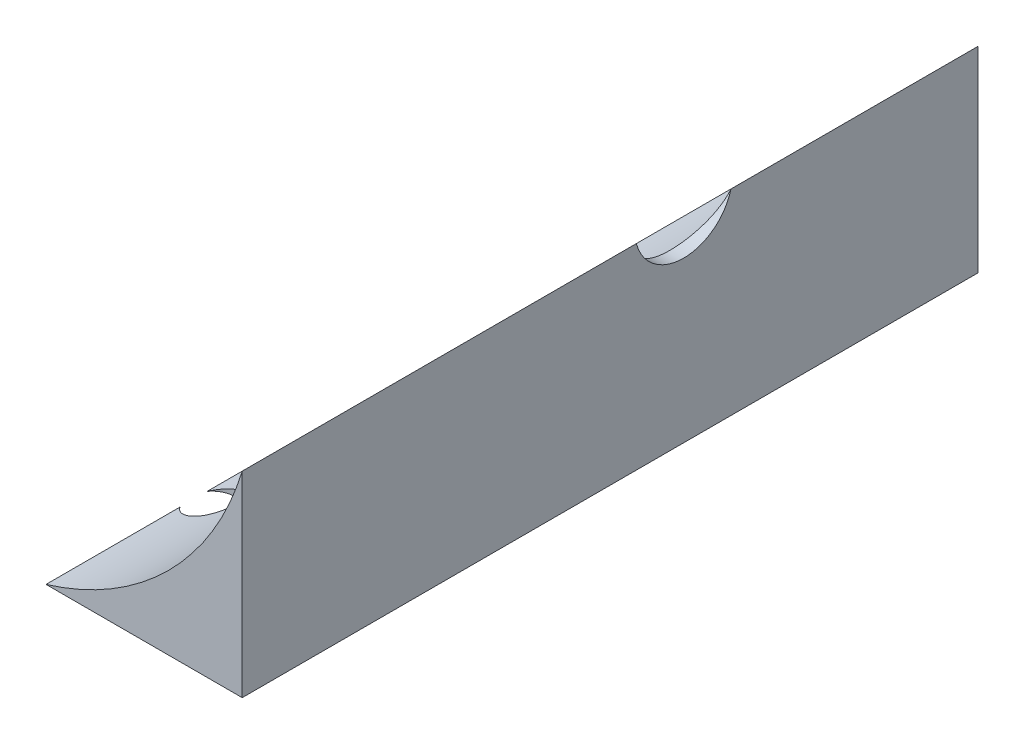
ISO-10303-21;
HEADER;
FILE_DESCRIPTION(('STEP AP214'),'2;1');
FILE_NAME('part.step','',(''),(''),'','','');
FILE_SCHEMA(('AUTOMOTIVE_DESIGN { 1 0 10303 214 1 1 1 1 }'));
ENDSEC;
DATA;
#1=APPLICATION_CONTEXT('core data for automotive mechanical design processes');
#2=APPLICATION_PROTOCOL_DEFINITION('international standard','automotive_design',2000,#1);
#3=PRODUCT_CONTEXT('',#1,'mechanical');
#4=PRODUCT('Part','Part','',(#3));
#5=PRODUCT_RELATED_PRODUCT_CATEGORY('part','',(#4));
#6=PRODUCT_DEFINITION_FORMATION('','',#4);
#7=PRODUCT_DEFINITION_CONTEXT('part definition',#1,'design');
#8=PRODUCT_DEFINITION('design','',#6,#7);
#9=PRODUCT_DEFINITION_SHAPE('','',#8);
#10=(LENGTH_UNIT() NAMED_UNIT(*) SI_UNIT(.MILLI.,.METRE.));
#11=(NAMED_UNIT(*) PLANE_ANGLE_UNIT() SI_UNIT($,.RADIAN.));
#12=(NAMED_UNIT(*) SI_UNIT($,.STERADIAN.) SOLID_ANGLE_UNIT());
#13=UNCERTAINTY_MEASURE_WITH_UNIT(LENGTH_MEASURE(1.E-05),#10,'distance_accuracy_value','');
#14=(GEOMETRIC_REPRESENTATION_CONTEXT(3) GLOBAL_UNCERTAINTY_ASSIGNED_CONTEXT((#13)) GLOBAL_UNIT_ASSIGNED_CONTEXT((#10,
#11,#12)) REPRESENTATION_CONTEXT('',''));
#15=CARTESIAN_POINT('',(0.,0.,0.));
#16=DIRECTION('',(0.,0.,1.));
#17=DIRECTION('',(1.,0.,0.));
#18=AXIS2_PLACEMENT_3D('',#15,#16,#17);
#19=CARTESIAN_POINT('',(0.,0.,75.));
#20=DIRECTION('',(0.,1.,0.));
#21=DIRECTION('',(-1.,0.,0.));
#22=AXIS2_PLACEMENT_3D('',#19,#20,#21);
#23=PLANE('',#22);
#24=DIRECTION('',(0.,0.,-1.));
#25=VECTOR('',#24,1.);
#26=CARTESIAN_POINT('',(-20.,0.,75.));
#27=LINE('',#26,#25);
#28=CARTESIAN_POINT('',(-20.,0.,75.));
#29=VERTEX_POINT('',#28);
#30=CARTESIAN_POINT('',(-20.,0.,61.3504253735184));
#31=VERTEX_POINT('',#30);
#32=EDGE_CURVE('E91',#29,#31,#27,.T.);
#33=ORIENTED_EDGE('',*,*,#32,.T.);
#34=CARTESIAN_POINT('',(-18.1137057403655,0.,59.963970786125));
#35=DIRECTION('',(0.,-1.,0.));
#36=DIRECTION('',(1.,0.,0.));
#37=AXIS2_PLACEMENT_3D('',#34,#35,#36);
#38=CIRCLE('',#37,2.34101737644858);
#39=CARTESIAN_POINT('',(-20.,0.,58.5775161987316));
#40=VERTEX_POINT('',#39);
#41=EDGE_CURVE('E52',#40,#31,#38,.T.);
#42=ORIENTED_EDGE('',*,*,#41,.F.);
#43=CARTESIAN_POINT('',(-20.,0.,0.));
#44=VERTEX_POINT('',#43);
#45=EDGE_CURVE('E88',#40,#44,#27,.T.);
#46=ORIENTED_EDGE('',*,*,#45,.T.);
#47=DIRECTION('',(1.,0.,0.));
#48=VECTOR('',#47,1.);
#49=CARTESIAN_POINT('',(0.,0.,0.));
#50=LINE('',#49,#48);
#51=CARTESIAN_POINT('',(0.,0.,0.));
#52=VERTEX_POINT('',#51);
#53=EDGE_CURVE('E148',#44,#52,#50,.T.);
#54=ORIENTED_EDGE('',*,*,#53,.T.);
#55=DIRECTION('',(0.,0.,-1.));
#56=VECTOR('',#55,1.);
#57=CARTESIAN_POINT('',(0.,0.,75.));
#58=LINE('',#57,#56);
#59=CARTESIAN_POINT('',(0.,0.,75.));
#60=VERTEX_POINT('',#59);
#61=EDGE_CURVE('E108',#60,#52,#58,.T.);
#62=ORIENTED_EDGE('',*,*,#61,.F.);
#63=DIRECTION('',(1.,0.,0.));
#64=VECTOR('',#63,1.);
#65=CARTESIAN_POINT('',(0.,0.,75.));
#66=LINE('',#65,#64);
#67=EDGE_CURVE('E145',#29,#60,#66,.T.);
#68=ORIENTED_EDGE('',*,*,#67,.F.);
#69=EDGE_LOOP('',(#33,#42,#46,#54,#62,#68));
#70=FACE_BOUND('',#69,.T.);
#71=ADVANCED_FACE('F34',(#70),#23,.F.);
#72=CARTESIAN_POINT('',(0.,0.,75.));
#73=DIRECTION('',(-1.,0.,0.));
#74=DIRECTION('',(0.,0.,1.));
#75=AXIS2_PLACEMENT_3D('',#72,#73,#74);
#76=PLANE('',#75);
#77=DIRECTION('',(0.,0.,-1.));
#78=VECTOR('',#77,1.);
#79=CARTESIAN_POINT('',(0.,20.,75.));
#80=LINE('',#79,#78);
#81=CARTESIAN_POINT('',(0.,20.,25.1719569181705));
#82=VERTEX_POINT('',#81);
#83=CARTESIAN_POINT('',(0.,20.,0.));
#84=VERTEX_POINT('',#83);
#85=EDGE_CURVE('E99',#82,#84,#80,.T.);
#86=ORIENTED_EDGE('',*,*,#85,.F.);
#87=CARTESIAN_POINT('',(0.,21.3,29.9999999999998));
#88=DIRECTION('',(1.,0.,0.));
#89=DIRECTION('',(0.,0.,-1.));
#90=AXIS2_PLACEMENT_3D('',#87,#88,#89);
#91=CIRCLE('',#90,5.);
#92=CARTESIAN_POINT('',(0.,20.,34.8280430818291));
#93=VERTEX_POINT('',#92);
#94=EDGE_CURVE('E58',#93,#82,#91,.T.);
#95=ORIENTED_EDGE('',*,*,#94,.F.);
#96=CARTESIAN_POINT('',(0.,20.,75.));
#97=VERTEX_POINT('',#96);
#98=EDGE_CURVE('E105',#97,#93,#80,.T.);
#99=ORIENTED_EDGE('',*,*,#98,.F.);
#100=DIRECTION('',(0.,1.,0.));
#101=VECTOR('',#100,1.);
#102=CARTESIAN_POINT('',(0.,0.,75.));
#103=LINE('',#102,#101);
#104=EDGE_CURVE('E100',#60,#97,#103,.T.);
#105=ORIENTED_EDGE('',*,*,#104,.F.);
#106=ORIENTED_EDGE('',*,*,#61,.T.);
#107=DIRECTION('',(0.,1.,0.));
#108=VECTOR('',#107,1.);
#109=CARTESIAN_POINT('',(0.,0.,0.));
#110=LINE('',#109,#108);
#111=EDGE_CURVE('E141',#52,#84,#110,.T.);
#112=ORIENTED_EDGE('',*,*,#111,.T.);
#113=EDGE_LOOP('',(#86,#95,#99,#105,#106,#112));
#114=FACE_BOUND('',#113,.T.);
#115=ADVANCED_FACE('F130',(#114),#76,.F.);
#116=CARTESIAN_POINT('',(-28.7082869338697,28.7082869338697,75.));
#117=DIRECTION('',(0.,0.,-1.));
#118=DIRECTION('',(-1.,0.,0.));
#119=AXIS2_PLACEMENT_3D('',#116,#117,#118);
#120=CYLINDRICAL_SURFACE('',#119,30.);
#121=ORIENTED_EDGE('',*,*,#45,.F.);
#122=CARTESIAN_POINT('',(-20.,0.,58.5775161987316));
#123=CARTESIAN_POINT('',(-19.9603852167004,0.0120163993603555,58.5236065563983));
#124=CARTESIAN_POINT('',(-19.9185346524436,0.0248009634564151,58.4715229348385));
#125=CARTESIAN_POINT('',(-19.8307699291893,0.0518426986991115,58.3713386677608));
#126=CARTESIAN_POINT('',(-19.7848569685702,0.066099435771002,58.3232368556878));
#127=CARTESIAN_POINT('',(-19.6894806363469,0.0959885123284485,58.2314392068463));
#128=CARTESIAN_POINT('',(-19.6400271890594,0.111617032416786,58.1877318207844));
#129=CARTESIAN_POINT('',(-19.5378958903817,0.144204413541176,58.104837592553));
#130=CARTESIAN_POINT('',(-19.4852178791001,0.161163340557791,58.0656509748262));
#131=CARTESIAN_POINT('',(-19.3230566683905,0.213896237302644,57.9552687608129));
#132=CARTESIAN_POINT('',(-19.2092917601135,0.251574387481096,57.8911031179173));
#133=CARTESIAN_POINT('',(-18.9740019781249,0.331198485191561,57.7829021524693));
#134=CARTESIAN_POINT('',(-18.8524734617509,0.373146441663057,57.738876359717));
#135=CARTESIAN_POINT('',(-18.6001609578884,0.462148316259254,57.6701823675214));
#136=CARTESIAN_POINT('',(-18.469200840092,0.509337464192126,57.6463348382152));
#137=CARTESIAN_POINT('',(-18.2060727754634,0.606273144824774,57.6210414309416));
#138=CARTESIAN_POINT('',(-18.0739045036713,0.656020383279902,57.6196017687446));
#139=CARTESIAN_POINT('',(-17.805069785958,0.759376239201831,57.6392837591402));
#140=CARTESIAN_POINT('',(-17.6685122778561,0.813053115037786,57.6615459459823));
#141=CARTESIAN_POINT('',(-17.4013495651599,0.920269575229427,57.7297086999404));
#142=CARTESIAN_POINT('',(-17.2707456176706,0.973809128357518,57.7756142344558));
#143=CARTESIAN_POINT('',(-17.0161137503511,1.08017523292484,57.8913747755031));
#144=CARTESIAN_POINT('',(-16.8923040275771,1.13295760265286,57.9617526123569));
#145=CARTESIAN_POINT('',(-16.6583444679612,1.23438733199774,58.1247843536203));
#146=CARTESIAN_POINT('',(-16.548194259832,1.28303480399639,58.2174376523462));
#147=CARTESIAN_POINT('',(-16.3487860228036,1.37233434831674,58.4196529821586));
#148=CARTESIAN_POINT('',(-16.2589616088891,1.41319620120892,58.5285613563386));
#149=CARTESIAN_POINT('',(-16.099408738527,1.48653223029614,58.7627213105352));
#150=CARTESIAN_POINT('',(-16.0296667988399,1.51901203261649,58.8879618427881));
#151=CARTESIAN_POINT('',(-15.9186856901359,1.57105149133239,59.1396492681334));
#152=CARTESIAN_POINT('',(-15.8755057492662,1.59148443410326,59.2650587463085));
#153=CARTESIAN_POINT('',(-15.8108651957181,1.62216831594949,59.5225318613281));
#154=CARTESIAN_POINT('',(-15.7893901072295,1.63242604118832,59.6545910014642));
#155=CARTESIAN_POINT('',(-15.770142147622,1.64161923428046,59.909371634492));
#156=CARTESIAN_POINT('',(-15.7704951178566,1.64144996949367,60.0319230566387));
#157=CARTESIAN_POINT('',(-15.7902536286833,1.63201438843243,60.2751073642671));
#158=CARTESIAN_POINT('',(-15.8096561023882,1.62274953650789,60.3957405553989));
#159=CARTESIAN_POINT('',(-15.8659693220632,1.59600542082622,60.6288780180972));
#160=CARTESIAN_POINT('',(-15.9024665612805,1.57872024912813,60.7415055172166));
#161=CARTESIAN_POINT('',(-15.9913555799345,1.53694069515482,60.9588504722534));
#162=CARTESIAN_POINT('',(-16.0437500407649,1.51244509671354,61.0635665900291));
#163=CARTESIAN_POINT('',(-16.165621627243,1.4560161647296,61.267880627343));
#164=CARTESIAN_POINT('',(-16.2358232378518,1.4237716199685,61.3669590833492));
#165=CARTESIAN_POINT('',(-16.3895292264913,1.35403083655854,61.5520726379876));
#166=CARTESIAN_POINT('',(-16.4730384099468,1.31653270140761,61.638103002908));
#167=CARTESIAN_POINT('',(-16.658965341979,1.23420731930407,61.8026734876179));
#168=CARTESIAN_POINT('',(-16.7624006007913,1.18902545256688,61.8798868924439));
#169=CARTESIAN_POINT('',(-16.9795530445125,1.0957757488691,62.015919191892));
#170=CARTESIAN_POINT('',(-17.0932740400071,1.04770684457365,62.0747312330299));
#171=CARTESIAN_POINT('',(-17.3373772098319,0.946421628248159,62.1767734542265));
#172=CARTESIAN_POINT('',(-17.4683676550296,0.893094946906978,62.2184445080831));
#173=CARTESIAN_POINT('',(-17.7356777929453,0.786564930145201,62.2783231053039));
#174=CARTESIAN_POINT('',(-17.8719988012845,0.733361628651809,62.296524818124));
#175=CARTESIAN_POINT('',(-18.1504140095533,0.627080638668843,62.3089631973864));
#176=CARTESIAN_POINT('',(-18.2925603279635,0.57405231364882,62.3024819963338));
#177=CARTESIAN_POINT('',(-18.5745111188379,0.471270456993035,62.2635933122109));
#178=CARTESIAN_POINT('',(-18.7143156227032,0.421516881420414,62.231186177062));
#179=CARTESIAN_POINT('',(-18.9837931840418,0.327763541425243,62.1418099826327));
#180=CARTESIAN_POINT('',(-19.1136283702825,0.283654832260102,62.0854452927666));
#181=CARTESIAN_POINT('',(-19.3622420379419,0.2009442529262,61.9493054999235));
#182=CARTESIAN_POINT('',(-19.4810327181965,0.162336281382611,61.8695566396365));
#183=CARTESIAN_POINT('',(-19.6682124097427,0.102632170047962,61.7171203832869));
#184=CARTESIAN_POINT('',(-19.7407172230383,0.079843360189809,61.6500751138656));
#185=CARTESIAN_POINT('',(-19.8771255165398,0.0374707372427867,61.5068640275036));
#186=CARTESIAN_POINT('',(-19.9410297688374,0.0178866364258815,61.430699030423));
#187=CARTESIAN_POINT('',(-20.,0.,61.3504253735185));
#188=B_SPLINE_CURVE_WITH_KNOTS('',3,(#122,#123,#124,#125,#126,#127,#128,#129,#130,#131,#132,
#133,#134,#135,#136,#137,#138,#139,#140,#141,#142,#143,#144,#145,#146,#147,#148,#149,#150,#151,
#152,#153,#154,#155,#156,#157,#158,#159,#160,#161,#162,#163,#164,#165,#166,#167,#168,#169,#170,
#171,#172,#173,#174,#175,#176,#177,#178,#179,#180,#181,#182,#183,#184,#185,#186,#187),
.UNSPECIFIED.,.F.,.F.,(4,2,2,2,2,2,2,2,2,2,2,2,2,2,2,2,2,2,2,2,2,2,2,2,2,2,2,2,2,2,2,2,4),(0.,
0.203831624930499,0.407603320164647,0.610824643973673,0.814056052775617,1.21986975760009,
1.62587528775139,2.04769295579348,2.46962763073394,2.9128238555078,3.35611323254066,
3.80952270825268,4.26291985687267,4.70145799956251,5.13970102048073,5.54011304535372,
5.94025784330446,6.3060981963826,6.67187966041526,7.02923716657789,7.38665498197951,
7.76198408414485,8.13744902775976,8.54597734865684,8.95465764300319,9.39498239516984,
9.83541651719867,10.2887565140752,10.7420904273113,11.1846100066247,11.6266348603919,
11.9298997969065,12.233137490462),.UNSPECIFIED.);
#189=EDGE_CURVE('E11',#40,#31,#188,.T.);
#190=ORIENTED_EDGE('',*,*,#189,.T.);
#191=ORIENTED_EDGE('',*,*,#32,.F.);
#192=CARTESIAN_POINT('',(-28.7082869338697,28.7082869338697,75.));
#193=DIRECTION('',(0.,0.,-1.));
#194=DIRECTION('',(-1.,0.,0.));
#195=AXIS2_PLACEMENT_3D('',#192,#193,#194);
#196=CIRCLE('',#195,30.);
#197=EDGE_CURVE('E97',#97,#29,#196,.T.);
#198=ORIENTED_EDGE('',*,*,#197,.F.);
#199=ORIENTED_EDGE('',*,*,#98,.T.);
#200=CARTESIAN_POINT('',(0.,20.,34.8280430818291));
#201=CARTESIAN_POINT('',(-0.042887026278017,19.8585842091166,34.7899741655263));
#202=CARTESIAN_POINT('',(-0.0863715901544593,19.7190227228772,34.7457241464061));
#203=CARTESIAN_POINT('',(-0.174044149430088,19.4445078905262,34.6452650537872));
#204=CARTESIAN_POINT('',(-0.218232110324775,19.3095543193926,34.5890565652381));
#205=CARTESIAN_POINT('',(-0.306867358888854,19.0450117615809,34.4650193607295));
#206=CARTESIAN_POINT('',(-0.351314857629725,18.9154281412724,34.3971793529178));
#207=CARTESIAN_POINT('',(-0.439887537125641,18.6626148951078,34.2503606588804));
#208=CARTESIAN_POINT('',(-0.484012716864898,18.5393852892689,34.171381937567));
#209=CARTESIAN_POINT('',(-0.571384595045427,18.3000707713527,34.0027316856505));
#210=CARTESIAN_POINT('',(-0.614630987590236,18.1839883195194,33.9130565038928));
#211=CARTESIAN_POINT('',(-0.699639914871906,17.959795369318,33.7235180518632));
#212=CARTESIAN_POINT('',(-0.74140192756869,17.8516876614831,33.6236512441858));
#213=CARTESIAN_POINT('',(-0.822770908320459,17.6443638810265,33.4143823116233));
#214=CARTESIAN_POINT('',(-0.862379023308245,17.5451430576324,33.3049853438466));
#215=CARTESIAN_POINT('',(-0.938808001284255,17.3563526114925,33.0772580758209));
#216=CARTESIAN_POINT('',(-0.97562907185665,17.2667822697504,32.9589284422069));
#217=CARTESIAN_POINT('',(-1.04503556523586,17.0999923683878,32.7168103864804));
#218=CARTESIAN_POINT('',(-1.07769740126124,17.0225410616619,32.5932036561227));
#219=CARTESIAN_POINT('',(-1.13909704816072,16.8784134825281,32.3389974918441));
#220=CARTESIAN_POINT('',(-1.16783657003949,16.8117325095057,32.2084011417931));
#221=CARTESIAN_POINT('',(-1.22081481232475,16.6898304457914,31.9411100757477));
#222=CARTESIAN_POINT('',(-1.24505433019101,16.6346073244134,31.8044164456067));
#223=CARTESIAN_POINT('',(-1.28850073332385,16.5362608011341,31.5259697324746));
#224=CARTESIAN_POINT('',(-1.30770806075715,16.4931363361288,31.384217095251));
#225=CARTESIAN_POINT('',(-1.33933406030908,16.4224497422271,31.1082243246949));
#226=CARTESIAN_POINT('',(-1.35216972045267,16.3939260299754,30.9742775958439));
#227=CARTESIAN_POINT('',(-1.37292025518578,16.3479322428485,30.7041269106709));
#228=CARTESIAN_POINT('',(-1.38083550158806,16.3304613327625,30.5679231257028));
#229=CARTESIAN_POINT('',(-1.39157077630319,16.306787515676,30.2943932282242));
#230=CARTESIAN_POINT('',(-1.39439278066974,16.3005802386554,30.157067571754));
#231=CARTESIAN_POINT('',(-1.39488461280556,16.2994975042032,29.8823640306354));
#232=CARTESIAN_POINT('',(-1.392554613579,16.304621666262,29.7449861478957));
#233=CARTESIAN_POINT('',(-1.38309924118561,16.325466745392,29.4798137277718));
#234=CARTESIAN_POINT('',(-1.37628087940518,16.3405093278537,29.3519541934166));
#235=CARTESIAN_POINT('',(-1.35828874684916,16.3803480664252,29.0980324591644));
#236=CARTESIAN_POINT('',(-1.34711356610042,16.4051473800756,28.9719708548257));
#237=CARTESIAN_POINT('',(-1.32062114039416,16.4642349840787,28.7225833255722));
#238=CARTESIAN_POINT('',(-1.30530523400811,16.4985202080068,28.5992565304928));
#239=CARTESIAN_POINT('',(-1.27079846465826,16.5762617857426,28.3560395531981));
#240=CARTESIAN_POINT('',(-1.25160612797161,16.6197216277978,28.2361506978578));
#241=CARTESIAN_POINT('',(-1.20935549371086,16.7161403901432,27.9987794494362));
#242=CARTESIAN_POINT('',(-1.1862430022915,16.7692333202247,27.8813610859061));
#243=CARTESIAN_POINT('',(-1.13674125979757,16.8839993605764,27.651497260674));
#244=CARTESIAN_POINT('',(-1.11035083107222,16.9456755554839,27.539053606005));
#245=CARTESIAN_POINT('',(-1.02686876945311,17.142845106302,27.2101424524249));
#246=CARTESIAN_POINT('',(-0.965435847716502,17.2905478797336,27.0019276730103));
#247=CARTESIAN_POINT('',(-0.829566881082832,17.626226400744,26.5974154886564));
#248=CARTESIAN_POINT('',(-0.754504475019445,17.8163760575968,26.4031460346678));
#249=CARTESIAN_POINT('',(-0.598979636749082,18.2242775482283,26.0486770404423));
#250=CARTESIAN_POINT('',(-0.518515701485232,18.4420370799772,25.888487035457));
#251=CARTESIAN_POINT('',(-0.364045593651393,18.877123494941,25.6195483367781));
#252=CARTESIAN_POINT('',(-0.290197505934445,19.0923195314056,25.5072589813344));
#253=CARTESIAN_POINT('',(-0.180322695320386,19.4255621424858,25.363067550934));
#254=CARTESIAN_POINT('',(-0.143857170673012,19.5383521374096,25.319052908121));
#255=CARTESIAN_POINT('',(-0.0714628333835565,19.7669943719074,25.2392704200911));
#256=CARTESIAN_POINT('',(-0.0355340792658576,19.8828469416366,25.2035034680754));
#257=CARTESIAN_POINT('',(0.,20.,25.1719569181705));
#258=B_SPLINE_CURVE_WITH_KNOTS('',3,(#200,#201,#202,#203,#204,#205,#206,#207,#208,#209,#210,
#211,#212,#213,#214,#215,#216,#217,#218,#219,#220,#221,#222,#223,#224,#225,#226,#227,#228,#229,
#230,#231,#232,#233,#234,#235,#236,#237,#238,#239,#240,#241,#242,#243,#244,#245,#246,#247,#248,
#249,#250,#251,#252,#253,#254,#255,#256,#257),.UNSPECIFIED.,.F.,.F.,(4,2,2,2,2,2,2,2,2,2,2,2,2,
2,2,2,2,2,2,2,2,2,2,2,2,2,2,2,4),(0.,0.457653646587653,0.915284912154802,1.37336298697981,
1.83144250481276,2.28967883445512,2.7480747575379,3.20622414908634,3.66433938318215,
4.11219105578068,4.55984673632457,5.0074230105218,5.45495994404505,5.86707498203185,
6.2791588746166,6.69108285430381,7.10299300180319,7.48930463567136,7.87574139334816,
8.26205337676468,8.6485125038162,9.04082997096181,9.43328879425895,10.2176631760238,
11.0601891384664,11.9029505261344,12.6615038916637,13.0405731122344,13.4196833656573),.UNSPECIFIED.);
#259=EDGE_CURVE('E46',#93,#82,#258,.T.);
#260=ORIENTED_EDGE('',*,*,#259,.T.);
#261=ORIENTED_EDGE('',*,*,#85,.T.);
#262=CARTESIAN_POINT('',(-28.7082869338697,28.7082869338697,0.));
#263=DIRECTION('',(0.,0.,-1.));
#264=DIRECTION('',(-1.,0.,0.));
#265=AXIS2_PLACEMENT_3D('',#262,#263,#264);
#266=CIRCLE('',#265,30.);
#267=EDGE_CURVE('E95',#84,#44,#266,.T.);
#268=ORIENTED_EDGE('',*,*,#267,.T.);
#269=EDGE_LOOP('',(#121,#190,#191,#198,#199,#260,#261,#268));
#270=FACE_BOUND('',#269,.T.);
#271=ADVANCED_FACE('F93',(#270),#120,.F.);
#272=CARTESIAN_POINT('',(-28.7082869338697,28.7082869338697,75.));
#273=DIRECTION('',(0.,0.,-1.));
#274=DIRECTION('',(-1.,0.,0.));
#275=AXIS2_PLACEMENT_3D('',#272,#273,#274);
#276=PLANE('',#275);
#277=ORIENTED_EDGE('',*,*,#67,.T.);
#278=ORIENTED_EDGE('',*,*,#104,.T.);
#279=ORIENTED_EDGE('',*,*,#197,.T.);
#280=EDGE_LOOP('',(#277,#278,#279));
#281=FACE_BOUND('',#280,.T.);
#282=ADVANCED_FACE('F122',(#281),#276,.F.);
#283=CARTESIAN_POINT('',(-28.7082869338697,28.7082869338697,0.));
#284=DIRECTION('',(0.,0.,-1.));
#285=DIRECTION('',(-1.,0.,0.));
#286=AXIS2_PLACEMENT_3D('',#283,#284,#285);
#287=PLANE('',#286);
#288=ORIENTED_EDGE('',*,*,#53,.F.);
#289=ORIENTED_EDGE('',*,*,#267,.F.);
#290=ORIENTED_EDGE('',*,*,#111,.F.);
#291=EDGE_LOOP('',(#288,#289,#290));
#292=FACE_BOUND('',#291,.T.);
#293=ADVANCED_FACE('F120',(#292),#287,.T.);
#294=CARTESIAN_POINT('',(-10.,21.3,29.9999999999998));
#295=DIRECTION('',(1.,0.,0.));
#296=DIRECTION('',(0.,0.,-1.));
#297=AXIS2_PLACEMENT_3D('',#294,#295,#296);
#298=CYLINDRICAL_SURFACE('',#297,5.);
#299=ORIENTED_EDGE('',*,*,#94,.T.);
#300=ORIENTED_EDGE('',*,*,#259,.F.);
#301=EDGE_LOOP('',(#299,#300));
#302=FACE_BOUND('',#301,.T.);
#303=ADVANCED_FACE('F116',(#302),#298,.F.);
#304=CARTESIAN_POINT('',(-18.1137057403655,10.,59.963970786125));
#305=DIRECTION('',(0.,-1.,0.));
#306=DIRECTION('',(1.,0.,0.));
#307=AXIS2_PLACEMENT_3D('',#304,#305,#306);
#308=CYLINDRICAL_SURFACE('',#307,2.34101737644858);
#309=ORIENTED_EDGE('',*,*,#41,.T.);
#310=ORIENTED_EDGE('',*,*,#189,.F.);
#311=EDGE_LOOP('',(#309,#310));
#312=FACE_BOUND('',#311,.T.);
#313=ADVANCED_FACE('F81',(#312),#308,.F.);
#314=CLOSED_SHELL('',(#71,#115,#271,#282,#293,#303,#313));
#315=MANIFOLD_SOLID_BREP('B2',#314);
#316=ADVANCED_BREP_SHAPE_REPRESENTATION('',(#18,#315),#14);
#317=SHAPE_DEFINITION_REPRESENTATION(#9,#316);
ENDSEC;
END-ISO-10303-21;
